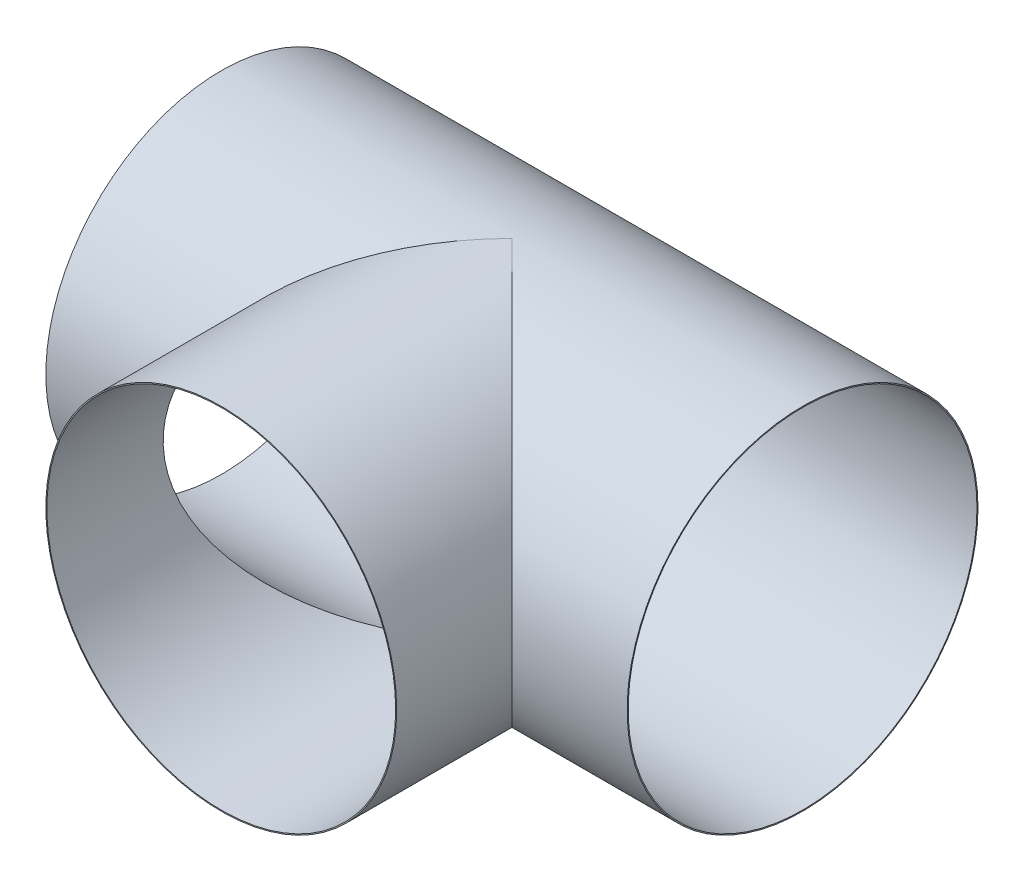
ISO-10303-21;
HEADER;
FILE_DESCRIPTION(('STEP AP214'),'2;1');
FILE_NAME('part.step','',(''),(''),'','','');
FILE_SCHEMA(('AUTOMOTIVE_DESIGN { 1 0 10303 214 1 1 1 1 }'));
ENDSEC;
DATA;
#1=APPLICATION_CONTEXT('core data for automotive mechanical design processes');
#2=APPLICATION_PROTOCOL_DEFINITION('international standard','automotive_design',2000,#1);
#3=PRODUCT_CONTEXT('',#1,'mechanical');
#4=PRODUCT('Part','Part','',(#3));
#5=PRODUCT_RELATED_PRODUCT_CATEGORY('part','',(#4));
#6=PRODUCT_DEFINITION_FORMATION('','',#4);
#7=PRODUCT_DEFINITION_CONTEXT('part definition',#1,'design');
#8=PRODUCT_DEFINITION('design','',#6,#7);
#9=PRODUCT_DEFINITION_SHAPE('','',#8);
#10=(LENGTH_UNIT() NAMED_UNIT(*) SI_UNIT(.MILLI.,.METRE.));
#11=(NAMED_UNIT(*) PLANE_ANGLE_UNIT() SI_UNIT($,.RADIAN.));
#12=(NAMED_UNIT(*) SI_UNIT($,.STERADIAN.) SOLID_ANGLE_UNIT());
#13=UNCERTAINTY_MEASURE_WITH_UNIT(LENGTH_MEASURE(1.E-05),#10,'distance_accuracy_value','');
#14=(GEOMETRIC_REPRESENTATION_CONTEXT(3) GLOBAL_UNCERTAINTY_ASSIGNED_CONTEXT((#13)) GLOBAL_UNIT_ASSIGNED_CONTEXT((#10,
#11,#12)) REPRESENTATION_CONTEXT('',''));
#15=CARTESIAN_POINT('',(0.,0.,0.));
#16=DIRECTION('',(0.,0.,1.));
#17=DIRECTION('',(1.,0.,0.));
#18=AXIS2_PLACEMENT_3D('',#15,#16,#17);
#19=CARTESIAN_POINT('',(0.,0.,-63.5));
#20=DIRECTION('',(0.,0.,1.));
#21=DIRECTION('',(1.,0.,0.));
#22=AXIS2_PLACEMENT_3D('',#19,#20,#21);
#23=CYLINDRICAL_SURFACE('',#22,38.32733);
#24=CARTESIAN_POINT('',(0.,0.,-63.5));
#25=DIRECTION('',(0.707106781186547,0.,0.707106781186547));
#26=DIRECTION('',(-0.707106781186547,0.,0.707106781186547));
#27=AXIS2_PLACEMENT_3D('',#24,#25,#26);
#28=ELLIPSE('',#27,54.2030298955492,38.32733);
#29=CARTESIAN_POINT('',(0.,-38.32733,-63.5));
#30=VERTEX_POINT('',#29);
#31=CARTESIAN_POINT('',(0.,38.32733,-63.5));
#32=VERTEX_POINT('',#31);
#33=EDGE_CURVE('E102',#30,#32,#28,.F.);
#34=ORIENTED_EDGE('',*,*,#33,.F.);
#35=CARTESIAN_POINT('',(0.,0.,-63.5));
#36=DIRECTION('',(-0.707106781186547,0.,0.707106781186547));
#37=DIRECTION('',(0.707106781186547,0.,0.707106781186547));
#38=AXIS2_PLACEMENT_3D('',#35,#36,#37);
#39=ELLIPSE('',#38,54.2030298955492,38.32733);
#40=EDGE_CURVE('E68',#32,#30,#39,.F.);
#41=ORIENTED_EDGE('',*,*,#40,.F.);
#42=EDGE_LOOP('',(#34,#41));
#43=FACE_BOUND('',#42,.T.);
#44=CARTESIAN_POINT('',(0.,0.,0.));
#45=DIRECTION('',(0.,0.,1.));
#46=DIRECTION('',(1.,0.,0.));
#47=AXIS2_PLACEMENT_3D('',#44,#45,#46);
#48=CIRCLE('',#47,38.32733);
#49=CARTESIAN_POINT('',(38.32733,0.,0.));
#50=VERTEX_POINT('',#49);
#51=EDGE_CURVE('E75',#50,#50,#48,.T.);
#52=ORIENTED_EDGE('',*,*,#51,.F.);
#53=EDGE_LOOP('',(#52));
#54=FACE_BOUND('',#53,.T.);
#55=ADVANCED_FACE('F50',(#43,#54),#23,.T.);
#56=CARTESIAN_POINT('',(0.,0.,0.));
#57=DIRECTION('',(0.,0.,1.));
#58=DIRECTION('',(1.,0.,0.));
#59=AXIS2_PLACEMENT_3D('',#56,#57,#58);
#60=PLANE('',#59);
#61=CARTESIAN_POINT('',(0.,0.,0.));
#62=DIRECTION('',(0.,0.,1.));
#63=DIRECTION('',(1.,0.,0.));
#64=AXIS2_PLACEMENT_3D('',#61,#62,#63);
#65=CIRCLE('',#64,38.1);
#66=CARTESIAN_POINT('',(38.1,0.,0.));
#67=VERTEX_POINT('',#66);
#68=EDGE_CURVE('E89',#67,#67,#65,.T.);
#69=ORIENTED_EDGE('',*,*,#68,.F.);
#70=EDGE_LOOP('',(#69));
#71=FACE_BOUND('',#70,.T.);
#72=ORIENTED_EDGE('',*,*,#51,.T.);
#73=EDGE_LOOP('',(#72));
#74=FACE_BOUND('',#73,.T.);
#75=ADVANCED_FACE('F107',(#71,#74),#60,.T.);
#76=CARTESIAN_POINT('',(-63.5,0.,-63.5));
#77=DIRECTION('',(1.,0.,0.));
#78=DIRECTION('',(0.,0.,-1.));
#79=AXIS2_PLACEMENT_3D('',#76,#77,#78);
#80=CYLINDRICAL_SURFACE('',#79,38.32733);
#81=ORIENTED_EDGE('',*,*,#40,.T.);
#82=ORIENTED_EDGE('',*,*,#33,.T.);
#83=EDGE_LOOP('',(#81,#82));
#84=FACE_BOUND('',#83,.T.);
#85=CARTESIAN_POINT('',(-63.5,0.,-63.5));
#86=DIRECTION('',(1.,0.,0.));
#87=DIRECTION('',(0.,0.,-1.));
#88=AXIS2_PLACEMENT_3D('',#85,#86,#87);
#89=CIRCLE('',#88,38.32733);
#90=CARTESIAN_POINT('',(-63.5,0.,-101.82733));
#91=VERTEX_POINT('',#90);
#92=EDGE_CURVE('E96',#91,#91,#89,.T.);
#93=ORIENTED_EDGE('',*,*,#92,.T.);
#94=EDGE_LOOP('',(#93));
#95=FACE_BOUND('',#94,.T.);
#96=CARTESIAN_POINT('',(63.5,0.,-63.5));
#97=DIRECTION('',(1.,0.,0.));
#98=DIRECTION('',(0.,0.,-1.));
#99=AXIS2_PLACEMENT_3D('',#96,#97,#98);
#100=CIRCLE('',#99,38.32733);
#101=CARTESIAN_POINT('',(63.5,0.,-101.82733));
#102=VERTEX_POINT('',#101);
#103=EDGE_CURVE('E91',#102,#102,#100,.T.);
#104=ORIENTED_EDGE('',*,*,#103,.F.);
#105=EDGE_LOOP('',(#104));
#106=FACE_BOUND('',#105,.T.);
#107=ADVANCED_FACE('F113',(#84,#95,#106),#80,.T.);
#108=CARTESIAN_POINT('',(-63.5,0.,-63.5));
#109=DIRECTION('',(1.,0.,0.));
#110=DIRECTION('',(0.,0.,-1.));
#111=AXIS2_PLACEMENT_3D('',#108,#109,#110);
#112=PLANE('',#111);
#113=CARTESIAN_POINT('',(-63.5,0.,-63.5));
#114=DIRECTION('',(1.,0.,0.));
#115=DIRECTION('',(0.,0.,-1.));
#116=AXIS2_PLACEMENT_3D('',#113,#114,#115);
#117=CIRCLE('',#116,38.1);
#118=CARTESIAN_POINT('',(-63.5,0.,-101.6));
#119=VERTEX_POINT('',#118);
#120=EDGE_CURVE('E84',#119,#119,#117,.T.);
#121=ORIENTED_EDGE('',*,*,#120,.T.);
#122=EDGE_LOOP('',(#121));
#123=FACE_BOUND('',#122,.T.);
#124=ORIENTED_EDGE('',*,*,#92,.F.);
#125=EDGE_LOOP('',(#124));
#126=FACE_BOUND('',#125,.T.);
#127=ADVANCED_FACE('F118',(#123,#126),#112,.F.);
#128=CARTESIAN_POINT('',(63.5,0.,-63.5));
#129=DIRECTION('',(1.,0.,0.));
#130=DIRECTION('',(0.,0.,-1.));
#131=AXIS2_PLACEMENT_3D('',#128,#129,#130);
#132=PLANE('',#131);
#133=CARTESIAN_POINT('',(63.5,0.,-63.5));
#134=DIRECTION('',(1.,0.,0.));
#135=DIRECTION('',(0.,0.,-1.));
#136=AXIS2_PLACEMENT_3D('',#133,#134,#135);
#137=CIRCLE('',#136,38.1);
#138=CARTESIAN_POINT('',(63.5,0.,-101.6));
#139=VERTEX_POINT('',#138);
#140=EDGE_CURVE('E87',#139,#139,#137,.T.);
#141=ORIENTED_EDGE('',*,*,#140,.F.);
#142=EDGE_LOOP('',(#141));
#143=FACE_BOUND('',#142,.T.);
#144=ORIENTED_EDGE('',*,*,#103,.T.);
#145=EDGE_LOOP('',(#144));
#146=FACE_BOUND('',#145,.T.);
#147=ADVANCED_FACE('F79',(#143,#146),#132,.T.);
#148=CARTESIAN_POINT('',(-63.5,0.,-63.5));
#149=DIRECTION('',(1.,0.,0.));
#150=DIRECTION('',(0.,0.,-1.));
#151=AXIS2_PLACEMENT_3D('',#148,#149,#150);
#152=CYLINDRICAL_SURFACE('',#151,38.1);
#153=CARTESIAN_POINT('',(0.,0.,-63.5));
#154=DIRECTION('',(0.707106781186547,0.,-0.707106781186547));
#155=DIRECTION('',(0.707106781186547,0.,0.707106781186547));
#156=AXIS2_PLACEMENT_3D('',#153,#154,#155);
#157=ELLIPSE('',#156,53.8815367264149,38.1);
#158=CARTESIAN_POINT('',(0.,-38.1,-63.5));
#159=VERTEX_POINT('',#158);
#160=CARTESIAN_POINT('',(0.,38.1,-63.5));
#161=VERTEX_POINT('',#160);
#162=EDGE_CURVE('E57',#159,#161,#157,.F.);
#163=ORIENTED_EDGE('',*,*,#162,.T.);
#164=CARTESIAN_POINT('',(0.,0.,-63.5));
#165=DIRECTION('',(0.707106781186547,0.,0.707106781186547));
#166=DIRECTION('',(0.707106781186547,0.,-0.707106781186547));
#167=AXIS2_PLACEMENT_3D('',#164,#165,#166);
#168=ELLIPSE('',#167,53.8815367264149,38.1);
#169=EDGE_CURVE('E13',#161,#159,#168,.T.);
#170=ORIENTED_EDGE('',*,*,#169,.T.);
#171=EDGE_LOOP('',(#163,#170));
#172=FACE_BOUND('',#171,.T.);
#173=ORIENTED_EDGE('',*,*,#120,.F.);
#174=EDGE_LOOP('',(#173));
#175=FACE_BOUND('',#174,.T.);
#176=ORIENTED_EDGE('',*,*,#140,.T.);
#177=EDGE_LOOP('',(#176));
#178=FACE_BOUND('',#177,.T.);
#179=ADVANCED_FACE('F76',(#172,#175,#178),#152,.F.);
#180=CARTESIAN_POINT('',(0.,0.,-63.5));
#181=DIRECTION('',(0.,0.,1.));
#182=DIRECTION('',(1.,0.,0.));
#183=AXIS2_PLACEMENT_3D('',#180,#181,#182);
#184=CYLINDRICAL_SURFACE('',#183,38.1);
#185=ORIENTED_EDGE('',*,*,#68,.T.);
#186=EDGE_LOOP('',(#185));
#187=FACE_BOUND('',#186,.T.);
#188=ORIENTED_EDGE('',*,*,#162,.F.);
#189=ORIENTED_EDGE('',*,*,#169,.F.);
#190=EDGE_LOOP('',(#188,#189));
#191=FACE_BOUND('',#190,.T.);
#192=ADVANCED_FACE('F73',(#187,#191),#184,.F.);
#193=CLOSED_SHELL('',(#55,#75,#107,#127,#147,#179,#192));
#194=MANIFOLD_SOLID_BREP('B2',#193);
#195=ADVANCED_BREP_SHAPE_REPRESENTATION('',(#18,#194),#14);
#196=SHAPE_DEFINITION_REPRESENTATION(#9,#195);
ENDSEC;
END-ISO-10303-21;
